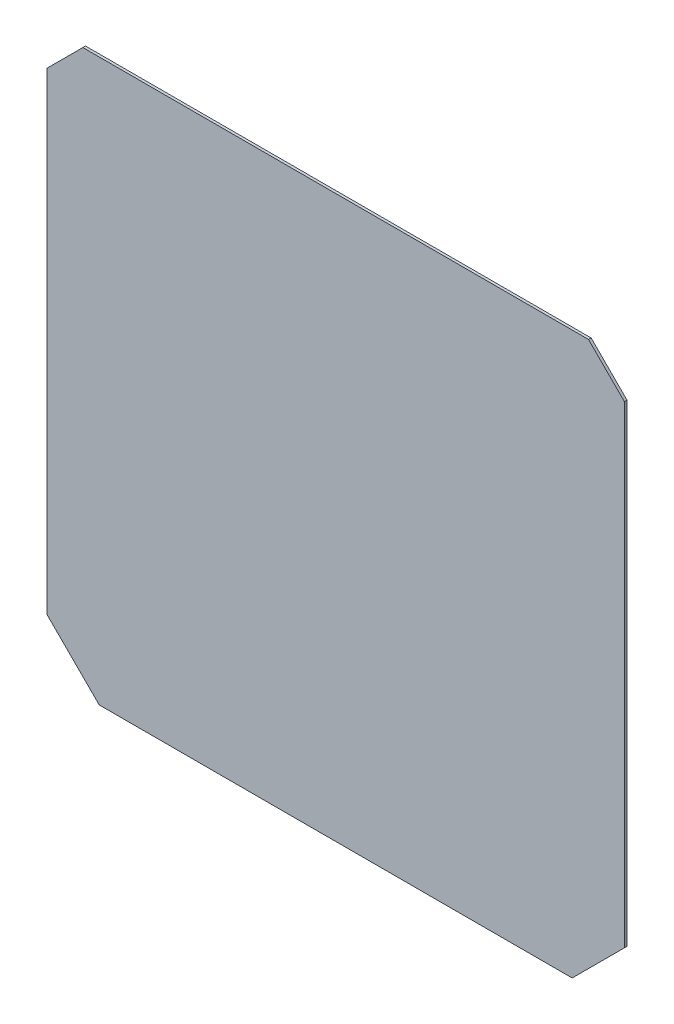
ISO-10303-21;
HEADER;
FILE_DESCRIPTION(('STEP AP214'),'2;1');
FILE_NAME('part.step','',(''),(''),'','','');
FILE_SCHEMA(('AUTOMOTIVE_DESIGN { 1 0 10303 214 1 1 1 1 }'));
ENDSEC;
DATA;
#1=APPLICATION_CONTEXT('core data for automotive mechanical design processes');
#2=APPLICATION_PROTOCOL_DEFINITION('international standard','automotive_design',2000,#1);
#3=PRODUCT_CONTEXT('',#1,'mechanical');
#4=PRODUCT('Part','Part','',(#3));
#5=PRODUCT_RELATED_PRODUCT_CATEGORY('part','',(#4));
#6=PRODUCT_DEFINITION_FORMATION('','',#4);
#7=PRODUCT_DEFINITION_CONTEXT('part definition',#1,'design');
#8=PRODUCT_DEFINITION('design','',#6,#7);
#9=PRODUCT_DEFINITION_SHAPE('','',#8);
#10=(LENGTH_UNIT() NAMED_UNIT(*) SI_UNIT(.MILLI.,.METRE.));
#11=(NAMED_UNIT(*) PLANE_ANGLE_UNIT() SI_UNIT($,.RADIAN.));
#12=(NAMED_UNIT(*) SI_UNIT($,.STERADIAN.) SOLID_ANGLE_UNIT());
#13=UNCERTAINTY_MEASURE_WITH_UNIT(LENGTH_MEASURE(1.E-05),#10,'distance_accuracy_value','');
#14=(GEOMETRIC_REPRESENTATION_CONTEXT(3) GLOBAL_UNCERTAINTY_ASSIGNED_CONTEXT((#13)) GLOBAL_UNIT_ASSIGNED_CONTEXT((#10,
#11,#12)) REPRESENTATION_CONTEXT('',''));
#15=CARTESIAN_POINT('',(0.,0.,0.));
#16=DIRECTION('',(0.,0.,1.));
#17=DIRECTION('',(1.,0.,0.));
#18=AXIS2_PLACEMENT_3D('',#15,#16,#17);
#19=CARTESIAN_POINT('',(-221.,181.,2.));
#20=DIRECTION('',(0.707106781186547,-0.707106781186548,0.));
#21=DIRECTION('',(0.707106781186548,0.707106781186547,0.));
#22=AXIS2_PLACEMENT_3D('',#19,#20,#21);
#23=PLANE('',#22);
#24=DIRECTION('',(0.,0.,1.));
#25=VECTOR('',#24,1.);
#26=CARTESIAN_POINT('',(-193.5,208.5,2.));
#27=LINE('',#26,#25);
#28=CARTESIAN_POINT('',(-193.5,208.5,0.));
#29=VERTEX_POINT('',#28);
#30=CARTESIAN_POINT('',(-193.5,208.5,2.));
#31=VERTEX_POINT('',#30);
#32=EDGE_CURVE('E217',#29,#31,#27,.T.);
#33=ORIENTED_EDGE('',*,*,#32,.F.);
#34=DIRECTION('',(-0.707106781186548,-0.707106781186547,0.));
#35=VECTOR('',#34,1.);
#36=CARTESIAN_POINT('',(-221.,181.,0.));
#37=LINE('',#36,#35);
#38=CARTESIAN_POINT('',(-221.,181.,0.));
#39=VERTEX_POINT('',#38);
#40=EDGE_CURVE('E169',#29,#39,#37,.T.);
#41=ORIENTED_EDGE('',*,*,#40,.T.);
#42=DIRECTION('',(0.,0.,-1.));
#43=VECTOR('',#42,1.);
#44=CARTESIAN_POINT('',(-221.,181.,2.));
#45=LINE('',#44,#43);
#46=CARTESIAN_POINT('',(-221.,181.,2.));
#47=VERTEX_POINT('',#46);
#48=EDGE_CURVE('E46',#47,#39,#45,.T.);
#49=ORIENTED_EDGE('',*,*,#48,.F.);
#50=DIRECTION('',(-0.707106781186548,-0.707106781186547,0.));
#51=VECTOR('',#50,1.);
#52=CARTESIAN_POINT('',(-221.,181.,2.));
#53=LINE('',#52,#51);
#54=EDGE_CURVE('E96',#31,#47,#53,.T.);
#55=ORIENTED_EDGE('',*,*,#54,.F.);
#56=EDGE_LOOP('',(#33,#41,#49,#55));
#57=FACE_BOUND('',#56,.T.);
#58=ADVANCED_FACE('F39',(#57),#23,.F.);
#59=CARTESIAN_POINT('',(181.,221.,2.));
#60=DIRECTION('',(-0.707106781186547,-0.707106781186548,0.));
#61=DIRECTION('',(0.707106781186548,-0.707106781186547,0.));
#62=AXIS2_PLACEMENT_3D('',#59,#60,#61);
#63=PLANE('',#62);
#64=DIRECTION('',(0.,0.,-1.));
#65=VECTOR('',#64,1.);
#66=CARTESIAN_POINT('',(193.5,208.5,2.));
#67=LINE('',#66,#65);
#68=CARTESIAN_POINT('',(193.5,208.5,2.));
#69=VERTEX_POINT('',#68);
#70=CARTESIAN_POINT('',(193.5,208.5,0.));
#71=VERTEX_POINT('',#70);
#72=EDGE_CURVE('E53',#69,#71,#67,.T.);
#73=ORIENTED_EDGE('',*,*,#72,.F.);
#74=DIRECTION('',(-0.707106781186548,0.707106781186547,0.));
#75=VECTOR('',#74,1.);
#76=CARTESIAN_POINT('',(181.,221.,2.));
#77=LINE('',#76,#75);
#78=CARTESIAN_POINT('',(221.,181.,2.));
#79=VERTEX_POINT('',#78);
#80=EDGE_CURVE('E130',#79,#69,#77,.T.);
#81=ORIENTED_EDGE('',*,*,#80,.F.);
#82=DIRECTION('',(0.,0.,-1.));
#83=VECTOR('',#82,1.);
#84=CARTESIAN_POINT('',(221.,181.,2.));
#85=LINE('',#84,#83);
#86=CARTESIAN_POINT('',(221.,181.,0.));
#87=VERTEX_POINT('',#86);
#88=EDGE_CURVE('E168',#79,#87,#85,.T.);
#89=ORIENTED_EDGE('',*,*,#88,.T.);
#90=DIRECTION('',(-0.707106781186548,0.707106781186547,0.));
#91=VECTOR('',#90,1.);
#92=CARTESIAN_POINT('',(181.,221.,0.));
#93=LINE('',#92,#91);
#94=EDGE_CURVE('E158',#87,#71,#93,.T.);
#95=ORIENTED_EDGE('',*,*,#94,.T.);
#96=EDGE_LOOP('',(#73,#81,#89,#95));
#97=FACE_BOUND('',#96,.T.);
#98=ADVANCED_FACE('F209',(#97),#63,.F.);
#99=CARTESIAN_POINT('',(0.,0.,2.));
#100=DIRECTION('',(0.,0.,-1.));
#101=DIRECTION('',(-1.,0.,0.));
#102=AXIS2_PLACEMENT_3D('',#99,#100,#101);
#103=PLANE('',#102);
#104=DIRECTION('',(1.,0.,0.));
#105=VECTOR('',#104,1.);
#106=CARTESIAN_POINT('',(0.,208.5,2.));
#107=LINE('',#106,#105);
#108=EDGE_CURVE('E159',#31,#69,#107,.T.);
#109=ORIENTED_EDGE('',*,*,#108,.F.);
#110=ORIENTED_EDGE('',*,*,#54,.T.);
#111=DIRECTION('',(0.,-1.,0.));
#112=VECTOR('',#111,1.);
#113=CARTESIAN_POINT('',(-221.,181.,2.));
#114=LINE('',#113,#112);
#115=CARTESIAN_POINT('',(-221.,-181.,2.));
#116=VERTEX_POINT('',#115);
#117=EDGE_CURVE('E147',#47,#116,#114,.T.);
#118=ORIENTED_EDGE('',*,*,#117,.T.);
#119=DIRECTION('',(0.707106781186547,-0.707106781186548,0.));
#120=VECTOR('',#119,1.);
#121=CARTESIAN_POINT('',(-221.,-181.,2.));
#122=LINE('',#121,#120);
#123=CARTESIAN_POINT('',(-181.,-221.,2.));
#124=VERTEX_POINT('',#123);
#125=EDGE_CURVE('E113',#116,#124,#122,.T.);
#126=ORIENTED_EDGE('',*,*,#125,.T.);
#127=DIRECTION('',(1.,0.,0.));
#128=VECTOR('',#127,1.);
#129=CARTESIAN_POINT('',(-181.,-221.,2.));
#130=LINE('',#129,#128);
#131=CARTESIAN_POINT('',(181.,-221.,2.));
#132=VERTEX_POINT('',#131);
#133=EDGE_CURVE('E106',#124,#132,#130,.T.);
#134=ORIENTED_EDGE('',*,*,#133,.T.);
#135=DIRECTION('',(0.707106781186547,0.707106781186548,0.));
#136=VECTOR('',#135,1.);
#137=CARTESIAN_POINT('',(181.,-221.,2.));
#138=LINE('',#137,#136);
#139=CARTESIAN_POINT('',(221.,-181.,2.));
#140=VERTEX_POINT('',#139);
#141=EDGE_CURVE('E110',#132,#140,#138,.T.);
#142=ORIENTED_EDGE('',*,*,#141,.T.);
#143=DIRECTION('',(0.,1.,0.));
#144=VECTOR('',#143,1.);
#145=CARTESIAN_POINT('',(221.,181.,2.));
#146=LINE('',#145,#144);
#147=EDGE_CURVE('E61',#140,#79,#146,.T.);
#148=ORIENTED_EDGE('',*,*,#147,.T.);
#149=ORIENTED_EDGE('',*,*,#80,.T.);
#150=EDGE_LOOP('',(#109,#110,#118,#126,#134,#142,#148,#149));
#151=FACE_BOUND('',#150,.T.);
#152=ADVANCED_FACE('F108',(#151),#103,.F.);
#153=CARTESIAN_POINT('',(0.,0.,0.));
#154=DIRECTION('',(0.,0.,-1.));
#155=DIRECTION('',(-1.,0.,0.));
#156=AXIS2_PLACEMENT_3D('',#153,#154,#155);
#157=PLANE('',#156);
#158=ORIENTED_EDGE('',*,*,#40,.F.);
#159=DIRECTION('',(1.,0.,0.));
#160=VECTOR('',#159,1.);
#161=CARTESIAN_POINT('',(0.,208.5,0.));
#162=LINE('',#161,#160);
#163=EDGE_CURVE('E12',#29,#71,#162,.T.);
#164=ORIENTED_EDGE('',*,*,#163,.T.);
#165=ORIENTED_EDGE('',*,*,#94,.F.);
#166=DIRECTION('',(0.,1.,0.));
#167=VECTOR('',#166,1.);
#168=CARTESIAN_POINT('',(221.,181.,0.));
#169=LINE('',#168,#167);
#170=CARTESIAN_POINT('',(221.,-181.,0.));
#171=VERTEX_POINT('',#170);
#172=EDGE_CURVE('E88',#171,#87,#169,.T.);
#173=ORIENTED_EDGE('',*,*,#172,.F.);
#174=DIRECTION('',(0.707106781186547,0.707106781186548,0.));
#175=VECTOR('',#174,1.);
#176=CARTESIAN_POINT('',(181.,-221.,0.));
#177=LINE('',#176,#175);
#178=CARTESIAN_POINT('',(181.,-221.,0.));
#179=VERTEX_POINT('',#178);
#180=EDGE_CURVE('E177',#179,#171,#177,.T.);
#181=ORIENTED_EDGE('',*,*,#180,.F.);
#182=DIRECTION('',(1.,0.,0.));
#183=VECTOR('',#182,1.);
#184=CARTESIAN_POINT('',(-181.,-221.,0.));
#185=LINE('',#184,#183);
#186=CARTESIAN_POINT('',(-181.,-221.,0.));
#187=VERTEX_POINT('',#186);
#188=EDGE_CURVE('E122',#187,#179,#185,.T.);
#189=ORIENTED_EDGE('',*,*,#188,.F.);
#190=DIRECTION('',(0.707106781186547,-0.707106781186548,0.));
#191=VECTOR('',#190,1.);
#192=CARTESIAN_POINT('',(-221.,-181.,0.));
#193=LINE('',#192,#191);
#194=CARTESIAN_POINT('',(-221.,-181.,0.));
#195=VERTEX_POINT('',#194);
#196=EDGE_CURVE('E174',#195,#187,#193,.T.);
#197=ORIENTED_EDGE('',*,*,#196,.F.);
#198=DIRECTION('',(0.,-1.,0.));
#199=VECTOR('',#198,1.);
#200=CARTESIAN_POINT('',(-221.,181.,0.));
#201=LINE('',#200,#199);
#202=EDGE_CURVE('E172',#39,#195,#201,.T.);
#203=ORIENTED_EDGE('',*,*,#202,.F.);
#204=EDGE_LOOP('',(#158,#164,#165,#173,#181,#189,#197,#203));
#205=FACE_BOUND('',#204,.T.);
#206=ADVANCED_FACE('F197',(#205),#157,.T.);
#207=CARTESIAN_POINT('',(-221.,181.,2.));
#208=DIRECTION('',(1.,0.,0.));
#209=DIRECTION('',(0.,1.,0.));
#210=AXIS2_PLACEMENT_3D('',#207,#208,#209);
#211=PLANE('',#210);
#212=ORIENTED_EDGE('',*,*,#202,.T.);
#213=DIRECTION('',(0.,0.,-1.));
#214=VECTOR('',#213,1.);
#215=CARTESIAN_POINT('',(-221.,-181.,2.));
#216=LINE('',#215,#214);
#217=EDGE_CURVE('E185',#116,#195,#216,.T.);
#218=ORIENTED_EDGE('',*,*,#217,.F.);
#219=ORIENTED_EDGE('',*,*,#117,.F.);
#220=ORIENTED_EDGE('',*,*,#48,.T.);
#221=EDGE_LOOP('',(#212,#218,#219,#220));
#222=FACE_BOUND('',#221,.T.);
#223=ADVANCED_FACE('F191',(#222),#211,.F.);
#224=CARTESIAN_POINT('',(-221.,-181.,2.));
#225=DIRECTION('',(0.707106781186548,0.707106781186547,0.));
#226=DIRECTION('',(-0.707106781186547,0.707106781186548,0.));
#227=AXIS2_PLACEMENT_3D('',#224,#225,#226);
#228=PLANE('',#227);
#229=ORIENTED_EDGE('',*,*,#196,.T.);
#230=DIRECTION('',(0.,0.,-1.));
#231=VECTOR('',#230,1.);
#232=CARTESIAN_POINT('',(-181.,-221.,2.));
#233=LINE('',#232,#231);
#234=EDGE_CURVE('E125',#124,#187,#233,.T.);
#235=ORIENTED_EDGE('',*,*,#234,.F.);
#236=ORIENTED_EDGE('',*,*,#125,.F.);
#237=ORIENTED_EDGE('',*,*,#217,.T.);
#238=EDGE_LOOP('',(#229,#235,#236,#237));
#239=FACE_BOUND('',#238,.T.);
#240=ADVANCED_FACE('F200',(#239),#228,.F.);
#241=CARTESIAN_POINT('',(-181.,-221.,2.));
#242=DIRECTION('',(0.,1.,0.));
#243=DIRECTION('',(0.,0.,1.));
#244=AXIS2_PLACEMENT_3D('',#241,#242,#243);
#245=PLANE('',#244);
#246=ORIENTED_EDGE('',*,*,#188,.T.);
#247=DIRECTION('',(0.,0.,-1.));
#248=VECTOR('',#247,1.);
#249=CARTESIAN_POINT('',(181.,-221.,2.));
#250=LINE('',#249,#248);
#251=EDGE_CURVE('E119',#132,#179,#250,.T.);
#252=ORIENTED_EDGE('',*,*,#251,.F.);
#253=ORIENTED_EDGE('',*,*,#133,.F.);
#254=ORIENTED_EDGE('',*,*,#234,.T.);
#255=EDGE_LOOP('',(#246,#252,#253,#254));
#256=FACE_BOUND('',#255,.T.);
#257=ADVANCED_FACE('F120',(#256),#245,.F.);
#258=CARTESIAN_POINT('',(181.,-221.,2.));
#259=DIRECTION('',(-0.707106781186548,0.707106781186547,0.));
#260=DIRECTION('',(-0.707106781186547,-0.707106781186548,0.));
#261=AXIS2_PLACEMENT_3D('',#258,#259,#260);
#262=PLANE('',#261);
#263=ORIENTED_EDGE('',*,*,#180,.T.);
#264=DIRECTION('',(0.,0.,-1.));
#265=VECTOR('',#264,1.);
#266=CARTESIAN_POINT('',(221.,-181.,2.));
#267=LINE('',#266,#265);
#268=EDGE_CURVE('E126',#140,#171,#267,.T.);
#269=ORIENTED_EDGE('',*,*,#268,.F.);
#270=ORIENTED_EDGE('',*,*,#141,.F.);
#271=ORIENTED_EDGE('',*,*,#251,.T.);
#272=EDGE_LOOP('',(#263,#269,#270,#271));
#273=FACE_BOUND('',#272,.T.);
#274=ADVANCED_FACE('F128',(#273),#262,.F.);
#275=CARTESIAN_POINT('',(221.,181.,2.));
#276=DIRECTION('',(-1.,0.,0.));
#277=DIRECTION('',(0.,-1.,0.));
#278=AXIS2_PLACEMENT_3D('',#275,#276,#277);
#279=PLANE('',#278);
#280=ORIENTED_EDGE('',*,*,#172,.T.);
#281=ORIENTED_EDGE('',*,*,#88,.F.);
#282=ORIENTED_EDGE('',*,*,#147,.F.);
#283=ORIENTED_EDGE('',*,*,#268,.T.);
#284=EDGE_LOOP('',(#280,#281,#282,#283));
#285=FACE_BOUND('',#284,.T.);
#286=ADVANCED_FACE('F224',(#285),#279,.F.);
#287=CARTESIAN_POINT('',(-215.,208.5,10.));
#288=DIRECTION('',(0.,1.,0.));
#289=DIRECTION('',(0.,0.,1.));
#290=AXIS2_PLACEMENT_3D('',#287,#288,#289);
#291=PLANE('',#290);
#292=ORIENTED_EDGE('',*,*,#108,.T.);
#293=ORIENTED_EDGE('',*,*,#72,.T.);
#294=ORIENTED_EDGE('',*,*,#163,.F.);
#295=ORIENTED_EDGE('',*,*,#32,.T.);
#296=EDGE_LOOP('',(#292,#293,#294,#295));
#297=FACE_BOUND('',#296,.T.);
#298=ADVANCED_FACE('F221',(#297),#291,.T.);
#299=CLOSED_SHELL('',(#58,#98,#152,#206,#223,#240,#257,#274,#286,#298));
#300=MANIFOLD_SOLID_BREP('B2',#299);
#301=ADVANCED_BREP_SHAPE_REPRESENTATION('',(#18,#300),#14);
#302=SHAPE_DEFINITION_REPRESENTATION(#9,#301);
ENDSEC;
END-ISO-10303-21;
